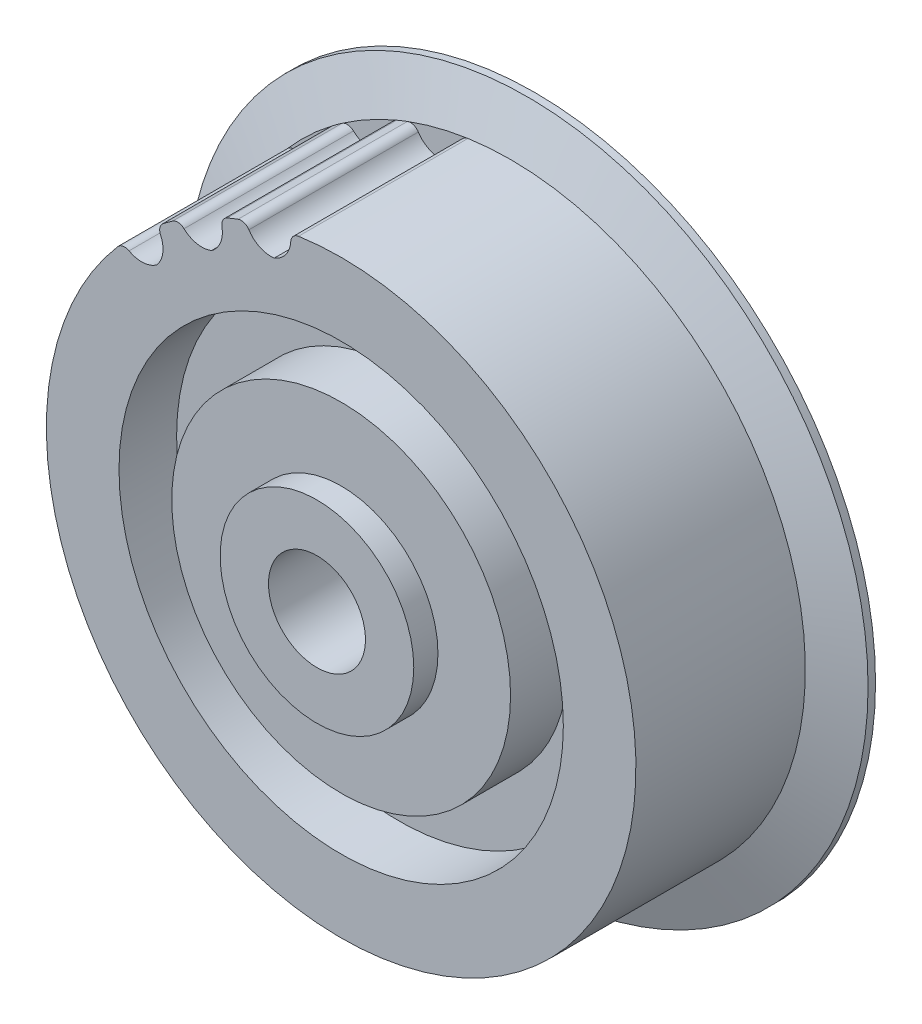
ISO-10303-21;
HEADER;
FILE_DESCRIPTION(('STEP AP214'),'2;1');
FILE_NAME('part.step','',(''),(''),'','','');
FILE_SCHEMA(('AUTOMOTIVE_DESIGN { 1 0 10303 214 1 1 1 1 }'));
ENDSEC;
DATA;
#1=APPLICATION_CONTEXT('core data for automotive mechanical design processes');
#2=APPLICATION_PROTOCOL_DEFINITION('international standard','automotive_design',2000,#1);
#3=PRODUCT_CONTEXT('',#1,'mechanical');
#4=PRODUCT('Part','Part','',(#3));
#5=PRODUCT_RELATED_PRODUCT_CATEGORY('part','',(#4));
#6=PRODUCT_DEFINITION_FORMATION('','',#4);
#7=PRODUCT_DEFINITION_CONTEXT('part definition',#1,'design');
#8=PRODUCT_DEFINITION('design','',#6,#7);
#9=PRODUCT_DEFINITION_SHAPE('','',#8);
#10=(LENGTH_UNIT() NAMED_UNIT(*) SI_UNIT(.MILLI.,.METRE.));
#11=(NAMED_UNIT(*) PLANE_ANGLE_UNIT() SI_UNIT($,.RADIAN.));
#12=(NAMED_UNIT(*) SI_UNIT($,.STERADIAN.) SOLID_ANGLE_UNIT());
#13=UNCERTAINTY_MEASURE_WITH_UNIT(LENGTH_MEASURE(1.E-05),#10,'distance_accuracy_value','');
#14=(GEOMETRIC_REPRESENTATION_CONTEXT(3) GLOBAL_UNCERTAINTY_ASSIGNED_CONTEXT((#13)) GLOBAL_UNIT_ASSIGNED_CONTEXT((#10,
#11,#12)) REPRESENTATION_CONTEXT('',''));
#15=CARTESIAN_POINT('',(0.,0.,0.));
#16=DIRECTION('',(0.,0.,1.));
#17=DIRECTION('',(1.,0.,0.));
#18=AXIS2_PLACEMENT_3D('',#15,#16,#17);
#19=CARTESIAN_POINT('',(0.,0.,7.14375));
#20=DIRECTION('',(0.,0.,-1.));
#21=DIRECTION('',(-1.,0.,0.));
#22=AXIS2_PLACEMENT_3D('',#19,#20,#21);
#23=CYLINDRICAL_SURFACE('',#22,3.18135);
#24=CARTESIAN_POINT('',(0.,0.,-13.49375));
#25=DIRECTION('',(0.,0.,-1.));
#26=DIRECTION('',(-1.,0.,0.));
#27=AXIS2_PLACEMENT_3D('',#24,#25,#26);
#28=CIRCLE('',#27,3.18135);
#29=CARTESIAN_POINT('',(-3.18135,0.,-13.49375));
#30=VERTEX_POINT('',#29);
#31=EDGE_CURVE('E19',#30,#30,#28,.F.);
#32=ORIENTED_EDGE('',*,*,#31,.F.);
#33=EDGE_LOOP('',(#32));
#34=FACE_BOUND('',#33,.T.);
#35=CARTESIAN_POINT('',(0.,0.,7.14375));
#36=DIRECTION('',(0.,0.,-1.));
#37=DIRECTION('',(-1.,0.,0.));
#38=AXIS2_PLACEMENT_3D('',#35,#36,#37);
#39=CIRCLE('',#38,3.18135);
#40=CARTESIAN_POINT('',(-3.18135,0.,7.14375));
#41=VERTEX_POINT('',#40);
#42=EDGE_CURVE('E270',#41,#41,#39,.T.);
#43=ORIENTED_EDGE('',*,*,#42,.F.);
#44=EDGE_LOOP('',(#43));
#45=FACE_BOUND('',#44,.T.);
#46=ADVANCED_FACE('F16',(#34,#45),#23,.F.);
#47=CARTESIAN_POINT('',(0.,0.,-13.49375));
#48=DIRECTION('',(0.,0.,-1.));
#49=DIRECTION('',(-1.,0.,0.));
#50=AXIS2_PLACEMENT_3D('',#47,#48,#49);
#51=PLANE('',#50);
#52=ORIENTED_EDGE('',*,*,#31,.T.);
#53=EDGE_LOOP('',(#52));
#54=FACE_BOUND('',#53,.T.);
#55=CARTESIAN_POINT('',(0.,0.,-13.49375));
#56=DIRECTION('',(0.,0.,-1.));
#57=DIRECTION('',(-1.,0.,0.));
#58=AXIS2_PLACEMENT_3D('',#55,#56,#57);
#59=CIRCLE('',#58,11.1125);
#60=CARTESIAN_POINT('',(-11.1125,0.,-13.49375));
#61=VERTEX_POINT('',#60);
#62=EDGE_CURVE('E268',#61,#61,#59,.F.);
#63=ORIENTED_EDGE('',*,*,#62,.F.);
#64=EDGE_LOOP('',(#63));
#65=FACE_BOUND('',#64,.T.);
#66=ADVANCED_FACE('F277',(#54,#65),#51,.T.);
#67=CARTESIAN_POINT('',(0.,0.,7.14375));
#68=DIRECTION('',(0.,0.,1.));
#69=DIRECTION('',(1.,0.,0.));
#70=AXIS2_PLACEMENT_3D('',#67,#68,#69);
#71=PLANE('',#70);
#72=ORIENTED_EDGE('',*,*,#42,.T.);
#73=EDGE_LOOP('',(#72));
#74=FACE_BOUND('',#73,.T.);
#75=CARTESIAN_POINT('',(0.,0.,7.14375));
#76=DIRECTION('',(0.,0.,1.));
#77=DIRECTION('',(1.,0.,0.));
#78=AXIS2_PLACEMENT_3D('',#75,#76,#77);
#79=CIRCLE('',#78,6.35);
#80=CARTESIAN_POINT('',(6.35,0.,7.14375));
#81=VERTEX_POINT('',#80);
#82=EDGE_CURVE('E265',#81,#81,#79,.F.);
#83=ORIENTED_EDGE('',*,*,#82,.F.);
#84=EDGE_LOOP('',(#83));
#85=FACE_BOUND('',#84,.T.);
#86=ADVANCED_FACE('F286',(#74,#85),#71,.T.);
#87=CARTESIAN_POINT('',(0.,0.,-7.14375));
#88=DIRECTION('',(0.,0.,-1.));
#89=DIRECTION('',(-1.,0.,0.));
#90=AXIS2_PLACEMENT_3D('',#87,#88,#89);
#91=CYLINDRICAL_SURFACE('',#90,11.1125);
#92=CARTESIAN_POINT('',(0.,0.,-1.778));
#93=DIRECTION('',(0.,0.,-1.));
#94=DIRECTION('',(-1.,0.,0.));
#95=AXIS2_PLACEMENT_3D('',#92,#93,#94);
#96=CIRCLE('',#95,11.1125);
#97=CARTESIAN_POINT('',(-11.1125,0.,-1.778));
#98=VERTEX_POINT('',#97);
#99=EDGE_CURVE('E262',#98,#98,#96,.T.);
#100=ORIENTED_EDGE('',*,*,#99,.T.);
#101=EDGE_LOOP('',(#100));
#102=FACE_BOUND('',#101,.T.);
#103=ORIENTED_EDGE('',*,*,#62,.T.);
#104=EDGE_LOOP('',(#103));
#105=FACE_BOUND('',#104,.T.);
#106=ADVANCED_FACE('F400',(#102,#105),#91,.T.);
#107=CARTESIAN_POINT('',(0.,0.,5.55625));
#108=DIRECTION('',(0.,0.,1.));
#109=DIRECTION('',(1.,0.,0.));
#110=AXIS2_PLACEMENT_3D('',#107,#108,#109);
#111=CYLINDRICAL_SURFACE('',#110,6.35);
#112=ORIENTED_EDGE('',*,*,#82,.T.);
#113=EDGE_LOOP('',(#112));
#114=FACE_BOUND('',#113,.T.);
#115=CARTESIAN_POINT('',(0.,0.,5.55625));
#116=DIRECTION('',(0.,0.,1.));
#117=DIRECTION('',(1.,0.,0.));
#118=AXIS2_PLACEMENT_3D('',#115,#116,#117);
#119=CIRCLE('',#118,6.35);
#120=CARTESIAN_POINT('',(6.35,0.,5.55625));
#121=VERTEX_POINT('',#120);
#122=EDGE_CURVE('E259',#121,#121,#119,.F.);
#123=ORIENTED_EDGE('',*,*,#122,.F.);
#124=EDGE_LOOP('',(#123));
#125=FACE_BOUND('',#124,.T.);
#126=ADVANCED_FACE('F396',(#114,#125),#111,.T.);
#127=CARTESIAN_POINT('',(0.,0.,-1.778));
#128=DIRECTION('',(0.,0.,1.));
#129=DIRECTION('',(1.,0.,0.));
#130=AXIS2_PLACEMENT_3D('',#127,#128,#129);
#131=PLANE('',#130);
#132=ORIENTED_EDGE('',*,*,#99,.F.);
#133=EDGE_LOOP('',(#132));
#134=FACE_BOUND('',#133,.T.);
#135=CARTESIAN_POINT('',(0.,0.,-1.778));
#136=DIRECTION('',(0.,0.,1.));
#137=DIRECTION('',(1.,0.,0.));
#138=AXIS2_PLACEMENT_3D('',#135,#136,#137);
#139=CIRCLE('',#138,14.57325);
#140=CARTESIAN_POINT('',(14.57325,0.,-1.778));
#141=VERTEX_POINT('',#140);
#142=EDGE_CURVE('E132',#141,#141,#139,.F.);
#143=ORIENTED_EDGE('',*,*,#142,.T.);
#144=EDGE_LOOP('',(#143));
#145=FACE_BOUND('',#144,.T.);
#146=ADVANCED_FACE('F392',(#134,#145),#131,.F.);
#147=CARTESIAN_POINT('',(0.,0.,5.55625));
#148=DIRECTION('',(0.,0.,1.));
#149=DIRECTION('',(1.,0.,0.));
#150=AXIS2_PLACEMENT_3D('',#147,#148,#149);
#151=PLANE('',#150);
#152=ORIENTED_EDGE('',*,*,#122,.T.);
#153=EDGE_LOOP('',(#152));
#154=FACE_BOUND('',#153,.T.);
#155=CARTESIAN_POINT('',(0.,0.,5.55625));
#156=DIRECTION('',(0.,0.,1.));
#157=DIRECTION('',(1.,0.,0.));
#158=AXIS2_PLACEMENT_3D('',#155,#156,#157);
#159=CIRCLE('',#158,11.1125);
#160=CARTESIAN_POINT('',(11.1125,0.,5.55625));
#161=VERTEX_POINT('',#160);
#162=EDGE_CURVE('E150',#161,#161,#159,.F.);
#163=ORIENTED_EDGE('',*,*,#162,.F.);
#164=EDGE_LOOP('',(#163));
#165=FACE_BOUND('',#164,.T.);
#166=ADVANCED_FACE('F388',(#154,#165),#151,.T.);
#167=CARTESIAN_POINT('',(0.,0.,-7.77875));
#168=DIRECTION('',(0.,0.,1.));
#169=DIRECTION('',(1.,0.,0.));
#170=AXIS2_PLACEMENT_3D('',#167,#168,#169);
#171=CYLINDRICAL_SURFACE('',#170,14.57325);
#172=ORIENTED_EDGE('',*,*,#142,.F.);
#173=EDGE_LOOP('',(#172));
#174=FACE_BOUND('',#173,.T.);
#175=CARTESIAN_POINT('',(0.,0.,-7.14375));
#176=DIRECTION('',(0.,0.,1.));
#177=DIRECTION('',(1.,0.,0.));
#178=AXIS2_PLACEMENT_3D('',#175,#176,#177);
#179=CIRCLE('',#178,14.57325);
#180=CARTESIAN_POINT('',(14.57325,0.,-7.14375));
#181=VERTEX_POINT('',#180);
#182=EDGE_CURVE('E147',#181,#181,#179,.F.);
#183=ORIENTED_EDGE('',*,*,#182,.T.);
#184=EDGE_LOOP('',(#183));
#185=FACE_BOUND('',#184,.T.);
#186=ADVANCED_FACE('F385',(#174,#185),#171,.F.);
#187=CARTESIAN_POINT('',(0.,0.,-5.55625));
#188=DIRECTION('',(0.,0.,1.));
#189=DIRECTION('',(1.,0.,0.));
#190=AXIS2_PLACEMENT_3D('',#187,#188,#189);
#191=CYLINDRICAL_SURFACE('',#190,19.33575);
#192=CARTESIAN_POINT('',(0.,0.,-5.55625));
#193=DIRECTION('',(0.,0.,1.));
#194=DIRECTION('',(1.,0.,0.));
#195=AXIS2_PLACEMENT_3D('',#192,#193,#194);
#196=CIRCLE('',#195,19.33575);
#197=CARTESIAN_POINT('',(-6.76746682181264,18.1127750739119,-5.55625000000021));
#198=VERTEX_POINT('',#197);
#199=CARTESIAN_POINT('',(-7.46577675699837,17.8362946117506,-5.55625));
#200=VERTEX_POINT('',#199);
#201=EDGE_CURVE('E131',#198,#200,#196,.T.);
#202=ORIENTED_EDGE('',*,*,#201,.T.);
#203=DIRECTION('',(0.,0.,1.));
#204=VECTOR('',#203,1.);
#205=CARTESIAN_POINT('',(-7.4657767571594,17.836294611683,5.55625));
#206=LINE('',#205,#204);
#207=CARTESIAN_POINT('',(-7.46577675715956,17.836294611683,5.55625));
#208=VERTEX_POINT('',#207);
#209=EDGE_CURVE('E129',#208,#200,#206,.F.);
#210=ORIENTED_EDGE('',*,*,#209,.F.);
#211=CARTESIAN_POINT('',(0.,0.,5.55625));
#212=DIRECTION('',(0.,0.,1.));
#213=DIRECTION('',(1.,0.,0.));
#214=AXIS2_PLACEMENT_3D('',#211,#212,#213);
#215=CIRCLE('',#214,19.33575);
#216=CARTESIAN_POINT('',(-6.76746682181282,18.1127750739124,5.55625));
#217=VERTEX_POINT('',#216);
#218=EDGE_CURVE('E120',#208,#217,#215,.F.);
#219=ORIENTED_EDGE('',*,*,#218,.T.);
#220=DIRECTION('',(0.,0.,1.));
#221=VECTOR('',#220,1.);
#222=CARTESIAN_POINT('',(-6.76746682200894,18.1127750738386,5.55625));
#223=LINE('',#222,#221);
#224=EDGE_CURVE('E126',#198,#217,#223,.T.);
#225=ORIENTED_EDGE('',*,*,#224,.F.);
#226=EDGE_LOOP('',(#202,#210,#219,#225));
#227=FACE_BOUND('',#226,.T.);
#228=ADVANCED_FACE('F124',(#227),#191,.T.);
#229=CARTESIAN_POINT('',(0.,0.,-5.55625));
#230=DIRECTION('',(0.,0.,1.));
#231=DIRECTION('',(1.,0.,0.));
#232=AXIS2_PLACEMENT_3D('',#229,#230,#231);
#233=CYLINDRICAL_SURFACE('',#232,19.33575);
#234=CARTESIAN_POINT('',(0.,0.,-5.55625));
#235=DIRECTION('',(0.,0.,1.));
#236=DIRECTION('',(1.,0.,0.));
#237=AXIS2_PLACEMENT_3D('',#234,#235,#236);
#238=CIRCLE('',#237,19.33575);
#239=CARTESIAN_POINT('',(-11.05931839647,15.8607283776005,-5.55625000000036));
#240=VERTEX_POINT('',#239);
#241=CARTESIAN_POINT('',(-11.6669317459823,15.4192714385952,-5.55624999999999));
#242=VERTEX_POINT('',#241);
#243=EDGE_CURVE('E162',#240,#242,#238,.T.);
#244=ORIENTED_EDGE('',*,*,#243,.T.);
#245=DIRECTION('',(0.,0.,1.));
#246=VECTOR('',#245,1.);
#247=CARTESIAN_POINT('',(-11.6669317461483,15.4192714384694,5.55625));
#248=LINE('',#247,#246);
#249=CARTESIAN_POINT('',(-11.6669317461493,15.419271438469,5.55625));
#250=VERTEX_POINT('',#249);
#251=EDGE_CURVE('E154',#250,#242,#248,.F.);
#252=ORIENTED_EDGE('',*,*,#251,.F.);
#253=CARTESIAN_POINT('',(0.,0.,5.55625));
#254=DIRECTION('',(0.,0.,1.));
#255=DIRECTION('',(1.,0.,0.));
#256=AXIS2_PLACEMENT_3D('',#253,#254,#255);
#257=CIRCLE('',#256,19.33575);
#258=CARTESIAN_POINT('',(-11.05931839647,15.8607283776005,5.55625));
#259=VERTEX_POINT('',#258);
#260=EDGE_CURVE('E164',#250,#259,#257,.F.);
#261=ORIENTED_EDGE('',*,*,#260,.T.);
#262=DIRECTION('',(0.,0.,1.));
#263=VECTOR('',#262,1.);
#264=CARTESIAN_POINT('',(-11.0593183966332,15.8607283774874,5.55625));
#265=LINE('',#264,#263);
#266=EDGE_CURVE('E158',#240,#259,#265,.T.);
#267=ORIENTED_EDGE('',*,*,#266,.F.);
#268=EDGE_LOOP('',(#244,#252,#261,#267));
#269=FACE_BOUND('',#268,.T.);
#270=ADVANCED_FACE('F378',(#269),#233,.T.);
#271=CARTESIAN_POINT('',(0.,0.,-7.77875));
#272=DIRECTION('',(0.,0.,1.));
#273=DIRECTION('',(1.,0.,0.));
#274=AXIS2_PLACEMENT_3D('',#271,#272,#273);
#275=CYLINDRICAL_SURFACE('',#274,11.1125);
#276=CARTESIAN_POINT('',(0.,0.,1.778));
#277=DIRECTION('',(0.,0.,1.));
#278=DIRECTION('',(1.,0.,0.));
#279=AXIS2_PLACEMENT_3D('',#276,#277,#278);
#280=CIRCLE('',#279,11.1125);
#281=CARTESIAN_POINT('',(11.1125,0.,1.778));
#282=VERTEX_POINT('',#281);
#283=EDGE_CURVE('E246',#282,#282,#280,.F.);
#284=ORIENTED_EDGE('',*,*,#283,.F.);
#285=EDGE_LOOP('',(#284));
#286=FACE_BOUND('',#285,.T.);
#287=ORIENTED_EDGE('',*,*,#162,.T.);
#288=EDGE_LOOP('',(#287));
#289=FACE_BOUND('',#288,.T.);
#290=ADVANCED_FACE('F374',(#286,#289),#275,.T.);
#291=CARTESIAN_POINT('',(0.,0.,-7.14375));
#292=DIRECTION('',(0.,0.,1.));
#293=DIRECTION('',(1.,0.,0.));
#294=AXIS2_PLACEMENT_3D('',#291,#292,#293);
#295=PLANE('',#294);
#296=ORIENTED_EDGE('',*,*,#182,.F.);
#297=EDGE_LOOP('',(#296));
#298=FACE_BOUND('',#297,.T.);
#299=CARTESIAN_POINT('',(0.,0.,-7.14375));
#300=DIRECTION('',(0.,0.,1.));
#301=DIRECTION('',(1.,0.,0.));
#302=AXIS2_PLACEMENT_3D('',#299,#300,#301);
#303=CIRCLE('',#302,22.352);
#304=CARTESIAN_POINT('',(22.352,0.,-7.14375));
#305=VERTEX_POINT('',#304);
#306=EDGE_CURVE('E233',#305,#305,#303,.T.);
#307=ORIENTED_EDGE('',*,*,#306,.F.);
#308=EDGE_LOOP('',(#307));
#309=FACE_BOUND('',#308,.T.);
#310=ADVANCED_FACE('F371',(#298,#309),#295,.F.);
#311=CARTESIAN_POINT('',(-6.55766423772124,17.5512493048607,5.55625));
#312=DIRECTION('',(0.,0.,1.));
#313=DIRECTION('',(1.,0.,0.));
#314=AXIS2_PLACEMENT_3D('',#311,#312,#313);
#315=CYLINDRICAL_SURFACE('',#314,0.59944);
#316=ORIENTED_EDGE('',*,*,#224,.T.);
#317=CARTESIAN_POINT('',(-6.55766423772124,17.5512493048607,5.55625));
#318=DIRECTION('',(0.,0.,1.));
#319=DIRECTION('',(1.,0.,0.));
#320=AXIS2_PLACEMENT_3D('',#317,#318,#319);
#321=CIRCLE('',#320,0.59944);
#322=CARTESIAN_POINT('',(-6.0509555970019,17.8715221057977,5.55625));
#323=VERTEX_POINT('',#322);
#324=EDGE_CURVE('E135',#217,#323,#321,.F.);
#325=ORIENTED_EDGE('',*,*,#324,.T.);
#326=DIRECTION('',(0.,0.,1.));
#327=VECTOR('',#326,1.);
#328=CARTESIAN_POINT('',(-6.05095559700222,17.8715221057976,5.55625));
#329=LINE('',#328,#327);
#330=CARTESIAN_POINT('',(-6.0509555970019,17.8715221057977,-5.55625));
#331=VERTEX_POINT('',#330);
#332=EDGE_CURVE('E224',#323,#331,#329,.F.);
#333=ORIENTED_EDGE('',*,*,#332,.T.);
#334=CARTESIAN_POINT('',(-6.55766423772124,17.5512493048607,-5.55625));
#335=DIRECTION('',(0.,0.,1.));
#336=DIRECTION('',(1.,0.,0.));
#337=AXIS2_PLACEMENT_3D('',#334,#335,#336);
#338=CIRCLE('',#337,0.59944);
#339=EDGE_CURVE('E145',#198,#331,#338,.F.);
#340=ORIENTED_EDGE('',*,*,#339,.F.);
#341=EDGE_LOOP('',(#316,#325,#333,#340));
#342=FACE_BOUND('',#341,.T.);
#343=ADVANCED_FACE('F143',(#342),#315,.T.);
#344=CARTESIAN_POINT('',(-7.23432541861258,17.2833401908807,5.55625));
#345=DIRECTION('',(0.,0.,1.));
#346=DIRECTION('',(1.,0.,0.));
#347=AXIS2_PLACEMENT_3D('',#344,#345,#346);
#348=CYLINDRICAL_SURFACE('',#347,0.59944);
#349=DIRECTION('',(0.,0.,1.));
#350=VECTOR('',#349,1.);
#351=CARTESIAN_POINT('',(-7.82294193993073,17.1699430814267,5.55625));
#352=LINE('',#351,#350);
#353=CARTESIAN_POINT('',(-7.82294193993019,17.1699430814265,-5.55625));
#354=VERTEX_POINT('',#353);
#355=CARTESIAN_POINT('',(-7.82294193993019,17.1699430814265,5.55625));
#356=VERTEX_POINT('',#355);
#357=EDGE_CURVE('E220',#354,#356,#352,.T.);
#358=ORIENTED_EDGE('',*,*,#357,.T.);
#359=CARTESIAN_POINT('',(-7.23432541861258,17.2833401908807,5.55625));
#360=DIRECTION('',(0.,0.,1.));
#361=DIRECTION('',(1.,0.,0.));
#362=AXIS2_PLACEMENT_3D('',#359,#360,#361);
#363=CIRCLE('',#362,0.59944);
#364=EDGE_CURVE('E157',#356,#208,#363,.F.);
#365=ORIENTED_EDGE('',*,*,#364,.T.);
#366=ORIENTED_EDGE('',*,*,#209,.T.);
#367=CARTESIAN_POINT('',(-7.23432541861258,17.2833401908807,-5.55625));
#368=DIRECTION('',(0.,0.,1.));
#369=DIRECTION('',(1.,0.,0.));
#370=AXIS2_PLACEMENT_3D('',#367,#368,#369);
#371=CIRCLE('',#370,0.59944);
#372=EDGE_CURVE('E240',#354,#200,#371,.F.);
#373=ORIENTED_EDGE('',*,*,#372,.F.);
#374=EDGE_LOOP('',(#358,#365,#366,#373));
#375=FACE_BOUND('',#374,.T.);
#376=ADVANCED_FACE('F364',(#375),#348,.T.);
#377=CARTESIAN_POINT('',(-10.7164613662216,15.3690197541164,5.55625));
#378=DIRECTION('',(0.,0.,1.));
#379=DIRECTION('',(1.,0.,0.));
#380=AXIS2_PLACEMENT_3D('',#377,#378,#379);
#381=CYLINDRICAL_SURFACE('',#380,0.59944);
#382=ORIENTED_EDGE('',*,*,#266,.T.);
#383=CARTESIAN_POINT('',(-10.7164613662216,15.3690197541164,5.55625));
#384=DIRECTION('',(0.,0.,1.));
#385=DIRECTION('',(1.,0.,0.));
#386=AXIS2_PLACEMENT_3D('',#383,#384,#385);
#387=CIRCLE('',#386,0.59944);
#388=CARTESIAN_POINT('',(-10.3053205159492,15.8052439107573,5.55625));
#389=VERTEX_POINT('',#388);
#390=EDGE_CURVE('E161',#259,#389,#387,.F.);
#391=ORIENTED_EDGE('',*,*,#390,.T.);
#392=DIRECTION('',(0.,0.,1.));
#393=VECTOR('',#392,1.);
#394=CARTESIAN_POINT('',(-10.3053205159495,15.8052439107573,5.55625));
#395=LINE('',#394,#393);
#396=CARTESIAN_POINT('',(-10.3053205159492,15.8052439107573,-5.55625));
#397=VERTEX_POINT('',#396);
#398=EDGE_CURVE('E216',#389,#397,#395,.F.);
#399=ORIENTED_EDGE('',*,*,#398,.T.);
#400=CARTESIAN_POINT('',(-10.7164613662216,15.3690197541164,-5.55625));
#401=DIRECTION('',(0.,0.,1.));
#402=DIRECTION('',(1.,0.,0.));
#403=AXIS2_PLACEMENT_3D('',#400,#401,#402);
#404=CIRCLE('',#403,0.59944);
#405=EDGE_CURVE('E243',#240,#397,#404,.F.);
#406=ORIENTED_EDGE('',*,*,#405,.F.);
#407=EDGE_LOOP('',(#382,#391,#399,#406));
#408=FACE_BOUND('',#407,.T.);
#409=ADVANCED_FACE('F360',(#408),#381,.T.);
#410=CARTESIAN_POINT('',(-11.3052377044959,14.9412487048749,5.55625));
#411=DIRECTION('',(0.,0.,1.));
#412=DIRECTION('',(1.,0.,0.));
#413=AXIS2_PLACEMENT_3D('',#410,#411,#412);
#414=CYLINDRICAL_SURFACE('',#413,0.59944);
#415=DIRECTION('',(0.,0.,1.));
#416=VECTOR('',#415,1.);
#417=CARTESIAN_POINT('',(-11.8471610410491,14.685031197868,5.55625));
#418=LINE('',#417,#416);
#419=CARTESIAN_POINT('',(-11.8471610410499,14.6850311978676,-5.55625));
#420=VERTEX_POINT('',#419);
#421=CARTESIAN_POINT('',(-11.8471610410499,14.6850311978676,5.55625));
#422=VERTEX_POINT('',#421);
#423=EDGE_CURVE('E209',#420,#422,#418,.T.);
#424=ORIENTED_EDGE('',*,*,#423,.T.);
#425=CARTESIAN_POINT('',(-11.3052377044959,14.9412487048749,5.55625));
#426=DIRECTION('',(0.,0.,1.));
#427=DIRECTION('',(1.,0.,0.));
#428=AXIS2_PLACEMENT_3D('',#425,#426,#427);
#429=CIRCLE('',#428,0.59944);
#430=EDGE_CURVE('E249',#422,#250,#429,.F.);
#431=ORIENTED_EDGE('',*,*,#430,.T.);
#432=ORIENTED_EDGE('',*,*,#251,.T.);
#433=CARTESIAN_POINT('',(-11.3052377044959,14.9412487048749,-5.55625));
#434=DIRECTION('',(0.,0.,1.));
#435=DIRECTION('',(1.,0.,0.));
#436=AXIS2_PLACEMENT_3D('',#433,#434,#435);
#437=CIRCLE('',#436,0.59944);
#438=EDGE_CURVE('E228',#420,#242,#437,.F.);
#439=ORIENTED_EDGE('',*,*,#438,.F.);
#440=EDGE_LOOP('',(#424,#431,#432,#439));
#441=FACE_BOUND('',#440,.T.);
#442=ADVANCED_FACE('F356',(#441),#414,.T.);
#443=CARTESIAN_POINT('',(0.,0.,1.778));
#444=DIRECTION('',(0.,0.,1.));
#445=DIRECTION('',(1.,0.,0.));
#446=AXIS2_PLACEMENT_3D('',#443,#444,#445);
#447=PLANE('',#446);
#448=ORIENTED_EDGE('',*,*,#283,.T.);
#449=EDGE_LOOP('',(#448));
#450=FACE_BOUND('',#449,.T.);
#451=CARTESIAN_POINT('',(0.,0.,1.778));
#452=DIRECTION('',(0.,0.,1.));
#453=DIRECTION('',(1.,0.,0.));
#454=AXIS2_PLACEMENT_3D('',#451,#452,#453);
#455=CIRCLE('',#454,14.57325);
#456=CARTESIAN_POINT('',(14.57325,0.,1.778));
#457=VERTEX_POINT('',#456);
#458=EDGE_CURVE('E206',#457,#457,#455,.T.);
#459=ORIENTED_EDGE('',*,*,#458,.T.);
#460=EDGE_LOOP('',(#459));
#461=FACE_BOUND('',#460,.T.);
#462=ADVANCED_FACE('F352',(#450,#461),#447,.T.);
#463=CARTESIAN_POINT('',(0.,0.,-5.55625));
#464=DIRECTION('',(0.,0.,1.));
#465=DIRECTION('',(1.,0.,0.));
#466=AXIS2_PLACEMENT_3D('',#463,#464,#465);
#467=PLANE('',#466);
#468=ORIENTED_EDGE('',*,*,#372,.T.);
#469=CARTESIAN_POINT('',(0.,0.,-5.55625000000071));
#470=DIRECTION('',(0.,0.,-1.));
#471=DIRECTION('',(-1.,0.,0.));
#472=AXIS2_PLACEMENT_3D('',#469,#470,#471);
#473=CIRCLE('',#472,19.33575);
#474=EDGE_CURVE('E200',#240,#200,#473,.T.);
#475=ORIENTED_EDGE('',*,*,#474,.F.);
#476=ORIENTED_EDGE('',*,*,#405,.T.);
#477=CARTESIAN_POINT('',(-9.13984073276102,17.0418284903871,-5.55625));
#478=DIRECTION('',(0.,0.,1.));
#479=DIRECTION('',(1.,0.,0.));
#480=AXIS2_PLACEMENT_3D('',#477,#478,#479);
#481=CIRCLE('',#480,1.69925999999975);
#482=CARTESIAN_POINT('',(-8.50278336365236,15.4665055215761,-5.55625));
#483=VERTEX_POINT('',#482);
#484=EDGE_CURVE('E214',#397,#483,#481,.T.);
#485=ORIENTED_EDGE('',*,*,#484,.T.);
#486=CARTESIAN_POINT('',(-9.4915201295964,16.8484911058968,-5.55625));
#487=DIRECTION('',(0.,0.,1.));
#488=DIRECTION('',(1.,0.,0.));
#489=AXIS2_PLACEMENT_3D('',#486,#487,#488);
#490=CIRCLE('',#489,1.69926);
#491=EDGE_CURVE('E217',#483,#354,#490,.T.);
#492=ORIENTED_EDGE('',*,*,#491,.T.);
#493=EDGE_LOOP('',(#468,#475,#476,#485,#492));
#494=FACE_BOUND('',#493,.T.);
#495=ADVANCED_FACE('F348',(#494),#467,.T.);
#496=CARTESIAN_POINT('',(0.,0.,-5.55625));
#497=DIRECTION('',(0.,0.,1.));
#498=DIRECTION('',(1.,0.,0.));
#499=AXIS2_PLACEMENT_3D('',#496,#497,#498);
#500=PLANE('',#499);
#501=CARTESIAN_POINT('',(-2.7088538606914,18.5394558490126,-5.55625));
#502=DIRECTION('',(0.,0.,1.));
#503=DIRECTION('',(1.,0.,0.));
#504=AXIS2_PLACEMENT_3D('',#501,#502,#503);
#505=CIRCLE('',#504,0.59944);
#506=CARTESIAN_POINT('',(-3.30717862595625,18.576004294544,-5.55625));
#507=VERTEX_POINT('',#506);
#508=CARTESIAN_POINT('',(-2.79551955710474,19.132597797171,-5.55625000000021));
#509=VERTEX_POINT('',#508);
#510=EDGE_CURVE('E236',#507,#509,#505,.F.);
#511=ORIENTED_EDGE('',*,*,#510,.T.);
#512=CARTESIAN_POINT('',(0.,0.,-5.55625000000043));
#513=DIRECTION('',(0.,0.,-1.));
#514=DIRECTION('',(-1.,0.,0.));
#515=AXIS2_PLACEMENT_3D('',#512,#513,#514);
#516=CIRCLE('',#515,19.3357499999992);
#517=EDGE_CURVE('E197',#198,#509,#516,.T.);
#518=ORIENTED_EDGE('',*,*,#517,.F.);
#519=ORIENTED_EDGE('',*,*,#339,.T.);
#520=CARTESIAN_POINT('',(-4.61456542479278,18.7794140711653,-5.55625));
#521=DIRECTION('',(0.,0.,1.));
#522=DIRECTION('',(1.,0.,0.));
#523=AXIS2_PLACEMENT_3D('',#520,#521,#522);
#524=CIRCLE('',#523,1.69925999999975);
#525=CARTESIAN_POINT('',(-4.38928927576162,17.0951530449948,-5.55625));
#526=VERTEX_POINT('',#525);
#527=EDGE_CURVE('E222',#331,#526,#524,.T.);
#528=ORIENTED_EDGE('',*,*,#527,.T.);
#529=CARTESIAN_POINT('',(-5.0032772190161,18.6796098456484,-5.55625));
#530=DIRECTION('',(0.,0.,1.));
#531=DIRECTION('',(1.,0.,0.));
#532=AXIS2_PLACEMENT_3D('',#529,#530,#531);
#533=CIRCLE('',#532,1.69926);
#534=EDGE_CURVE('E225',#526,#507,#533,.T.);
#535=ORIENTED_EDGE('',*,*,#534,.T.);
#536=EDGE_LOOP('',(#511,#518,#519,#528,#535));
#537=FACE_BOUND('',#536,.T.);
#538=ADVANCED_FACE('F344',(#537),#500,.T.);
#539=CARTESIAN_POINT('',(0.,0.,-7.223125));
#540=DIRECTION('',(0.,0.,1.));
#541=DIRECTION('',(1.,0.,0.));
#542=AXIS2_PLACEMENT_3D('',#539,#540,#541);
#543=CYLINDRICAL_SURFACE('',#542,22.352);
#544=ORIENTED_EDGE('',*,*,#306,.T.);
#545=EDGE_LOOP('',(#544));
#546=FACE_BOUND('',#545,.T.);
#547=CARTESIAN_POINT('',(0.,0.,-6.65407521910674));
#548=DIRECTION('',(0.,0.,-1.));
#549=DIRECTION('',(0.,-1.,0.));
#550=AXIS2_PLACEMENT_3D('',#547,#548,#549);
#551=CIRCLE('',#550,22.3519999999994);
#552=CARTESIAN_POINT('',(0.,-22.3519999999994,-6.65407521910674));
#553=VERTEX_POINT('',#552);
#554=EDGE_CURVE('E196',#553,#553,#551,.F.);
#555=ORIENTED_EDGE('',*,*,#554,.F.);
#556=EDGE_LOOP('',(#555));
#557=FACE_BOUND('',#556,.T.);
#558=ADVANCED_FACE('F340',(#546,#557),#543,.T.);
#559=CARTESIAN_POINT('',(0.,0.,-5.55625));
#560=DIRECTION('',(0.,0.,1.));
#561=DIRECTION('',(1.,0.,0.));
#562=AXIS2_PLACEMENT_3D('',#559,#560,#561);
#563=PLANE('',#562);
#564=ORIENTED_EDGE('',*,*,#438,.T.);
#565=CARTESIAN_POINT('',(0.,0.,-5.55625000000036));
#566=DIRECTION('',(0.,0.,-1.));
#567=DIRECTION('',(-1.,0.,0.));
#568=AXIS2_PLACEMENT_3D('',#565,#566,#567);
#569=CIRCLE('',#568,19.335749999999);
#570=CARTESIAN_POINT('',(-14.6562723228631,12.6120937857506,-5.55625000000017));
#571=VERTEX_POINT('',#570);
#572=EDGE_CURVE('E193',#571,#242,#569,.T.);
#573=ORIENTED_EDGE('',*,*,#572,.F.);
#574=CARTESIAN_POINT('',(-14.2019038146928,12.2210981689181,-5.55625));
#575=DIRECTION('',(0.,0.,1.));
#576=DIRECTION('',(1.,0.,0.));
#577=AXIS2_PLACEMENT_3D('',#574,#575,#576);
#578=CIRCLE('',#577,0.59944);
#579=CARTESIAN_POINT('',(-13.9121642465605,12.7458641131813,-5.55625));
#580=VERTEX_POINT('',#579);
#581=EDGE_CURVE('E231',#571,#580,#578,.F.);
#582=ORIENTED_EDGE('',*,*,#581,.T.);
#583=CARTESIAN_POINT('',(-13.0908262335073,14.2334421500946,-5.55625));
#584=DIRECTION('',(0.,0.,1.));
#585=DIRECTION('',(1.,0.,0.));
#586=AXIS2_PLACEMENT_3D('',#583,#584,#585);
#587=CIRCLE('',#586,1.69925999999975);
#588=CARTESIAN_POINT('',(-12.0820163017529,12.866040574407,-5.55625));
#589=VERTEX_POINT('',#588);
#590=EDGE_CURVE('E204',#580,#589,#587,.T.);
#591=ORIENTED_EDGE('',*,*,#590,.T.);
#592=CARTESIAN_POINT('',(-13.3833759230625,13.9587197055451,-5.55625));
#593=DIRECTION('',(0.,0.,1.));
#594=DIRECTION('',(1.,0.,0.));
#595=AXIS2_PLACEMENT_3D('',#592,#593,#594);
#596=CIRCLE('',#595,1.69926);
#597=EDGE_CURVE('E210',#589,#420,#596,.T.);
#598=ORIENTED_EDGE('',*,*,#597,.T.);
#599=EDGE_LOOP('',(#564,#573,#582,#591,#598));
#600=FACE_BOUND('',#599,.T.);
#601=ADVANCED_FACE('F336',(#600),#563,.T.);
#602=CARTESIAN_POINT('',(-5.0032772190161,18.6796098456484,5.55625));
#603=DIRECTION('',(0.,0.,1.));
#604=DIRECTION('',(1.,0.,0.));
#605=AXIS2_PLACEMENT_3D('',#602,#603,#604);
#606=CYLINDRICAL_SURFACE('',#605,1.69926);
#607=ORIENTED_EDGE('',*,*,#534,.F.);
#608=DIRECTION('',(0.,0.,1.));
#609=VECTOR('',#608,1.);
#610=CARTESIAN_POINT('',(-4.38928927576249,17.0951530449947,5.55625));
#611=LINE('',#610,#609);
#612=CARTESIAN_POINT('',(-4.38928927576162,17.0951530449948,5.55625));
#613=VERTEX_POINT('',#612);
#614=EDGE_CURVE('E221',#526,#613,#611,.T.);
#615=ORIENTED_EDGE('',*,*,#614,.T.);
#616=CARTESIAN_POINT('',(-5.0032772190161,18.6796098456484,5.55625));
#617=DIRECTION('',(0.,0.,1.));
#618=DIRECTION('',(1.,0.,0.));
#619=AXIS2_PLACEMENT_3D('',#616,#617,#618);
#620=CIRCLE('',#619,1.69926);
#621=CARTESIAN_POINT('',(-3.30717862595614,18.576004294544,5.55625));
#622=VERTEX_POINT('',#621);
#623=EDGE_CURVE('E187',#622,#613,#620,.F.);
#624=ORIENTED_EDGE('',*,*,#623,.F.);
#625=DIRECTION('',(0.,0.,1.));
#626=VECTOR('',#625,1.);
#627=CARTESIAN_POINT('',(-3.30717862595626,18.5760042945439,5.55625));
#628=LINE('',#627,#626);
#629=EDGE_CURVE('E192',#507,#622,#628,.T.);
#630=ORIENTED_EDGE('',*,*,#629,.F.);
#631=EDGE_LOOP('',(#607,#615,#624,#630));
#632=FACE_BOUND('',#631,.T.);
#633=ADVANCED_FACE('F332',(#632),#606,.F.);
#634=CARTESIAN_POINT('',(-4.61456542479278,18.7794140711653,5.55625));
#635=DIRECTION('',(0.,0.,1.));
#636=DIRECTION('',(1.,0.,0.));
#637=AXIS2_PLACEMENT_3D('',#634,#635,#636);
#638=CYLINDRICAL_SURFACE('',#637,1.69925999999975);
#639=ORIENTED_EDGE('',*,*,#527,.F.);
#640=ORIENTED_EDGE('',*,*,#332,.F.);
#641=CARTESIAN_POINT('',(-4.61456542479278,18.7794140711653,5.55625));
#642=DIRECTION('',(0.,0.,1.));
#643=DIRECTION('',(1.,0.,0.));
#644=AXIS2_PLACEMENT_3D('',#641,#642,#643);
#645=CIRCLE('',#644,1.69925999999975);
#646=EDGE_CURVE('E139',#613,#323,#645,.F.);
#647=ORIENTED_EDGE('',*,*,#646,.F.);
#648=ORIENTED_EDGE('',*,*,#614,.F.);
#649=EDGE_LOOP('',(#639,#640,#647,#648));
#650=FACE_BOUND('',#649,.T.);
#651=ADVANCED_FACE('F328',(#650),#638,.F.);
#652=CARTESIAN_POINT('',(-9.4915201295964,16.8484911058968,5.55625));
#653=DIRECTION('',(0.,0.,1.));
#654=DIRECTION('',(1.,0.,0.));
#655=AXIS2_PLACEMENT_3D('',#652,#653,#654);
#656=CYLINDRICAL_SURFACE('',#655,1.69926);
#657=ORIENTED_EDGE('',*,*,#491,.F.);
#658=DIRECTION('',(0.,0.,1.));
#659=VECTOR('',#658,1.);
#660=CARTESIAN_POINT('',(-8.50278336365277,15.466505521576,5.55625));
#661=LINE('',#660,#659);
#662=CARTESIAN_POINT('',(-8.50278336365236,15.4665055215761,5.55625));
#663=VERTEX_POINT('',#662);
#664=EDGE_CURVE('E213',#483,#663,#661,.T.);
#665=ORIENTED_EDGE('',*,*,#664,.T.);
#666=CARTESIAN_POINT('',(-9.4915201295964,16.8484911058968,5.55625));
#667=DIRECTION('',(0.,0.,1.));
#668=DIRECTION('',(1.,0.,0.));
#669=AXIS2_PLACEMENT_3D('',#666,#667,#668);
#670=CIRCLE('',#669,1.69926);
#671=EDGE_CURVE('E183',#356,#663,#670,.F.);
#672=ORIENTED_EDGE('',*,*,#671,.F.);
#673=ORIENTED_EDGE('',*,*,#357,.F.);
#674=EDGE_LOOP('',(#657,#665,#672,#673));
#675=FACE_BOUND('',#674,.T.);
#676=ADVANCED_FACE('F324',(#675),#656,.F.);
#677=CARTESIAN_POINT('',(-9.13984073276102,17.0418284903871,5.55625));
#678=DIRECTION('',(0.,0.,1.));
#679=DIRECTION('',(1.,0.,0.));
#680=AXIS2_PLACEMENT_3D('',#677,#678,#679);
#681=CYLINDRICAL_SURFACE('',#680,1.69925999999975);
#682=ORIENTED_EDGE('',*,*,#484,.F.);
#683=ORIENTED_EDGE('',*,*,#398,.F.);
#684=CARTESIAN_POINT('',(-9.13984073276102,17.0418284903871,5.55625));
#685=DIRECTION('',(0.,0.,1.));
#686=DIRECTION('',(1.,0.,0.));
#687=AXIS2_PLACEMENT_3D('',#684,#685,#686);
#688=CIRCLE('',#687,1.69925999999975);
#689=EDGE_CURVE('E180',#663,#389,#688,.F.);
#690=ORIENTED_EDGE('',*,*,#689,.F.);
#691=ORIENTED_EDGE('',*,*,#664,.F.);
#692=EDGE_LOOP('',(#682,#683,#690,#691));
#693=FACE_BOUND('',#692,.T.);
#694=ADVANCED_FACE('F320',(#693),#681,.F.);
#695=CARTESIAN_POINT('',(-13.3833759230625,13.9587197055451,5.55625));
#696=DIRECTION('',(0.,0.,1.));
#697=DIRECTION('',(1.,0.,0.));
#698=AXIS2_PLACEMENT_3D('',#695,#696,#697);
#699=CYLINDRICAL_SURFACE('',#698,1.69926);
#700=ORIENTED_EDGE('',*,*,#597,.F.);
#701=DIRECTION('',(0.,0.,1.));
#702=VECTOR('',#701,1.);
#703=CARTESIAN_POINT('',(-12.0820163017528,12.866040574407,5.55625));
#704=LINE('',#703,#702);
#705=CARTESIAN_POINT('',(-12.0820163017529,12.866040574407,5.55625));
#706=VERTEX_POINT('',#705);
#707=EDGE_CURVE('E203',#589,#706,#704,.T.);
#708=ORIENTED_EDGE('',*,*,#707,.T.);
#709=CARTESIAN_POINT('',(-13.3833759230625,13.9587197055451,5.55625));
#710=DIRECTION('',(0.,0.,1.));
#711=DIRECTION('',(1.,0.,0.));
#712=AXIS2_PLACEMENT_3D('',#709,#710,#711);
#713=CIRCLE('',#712,1.69926);
#714=EDGE_CURVE('E177',#422,#706,#713,.F.);
#715=ORIENTED_EDGE('',*,*,#714,.F.);
#716=ORIENTED_EDGE('',*,*,#423,.F.);
#717=EDGE_LOOP('',(#700,#708,#715,#716));
#718=FACE_BOUND('',#717,.T.);
#719=ADVANCED_FACE('F316',(#718),#699,.F.);
#720=CARTESIAN_POINT('',(0.,0.,-7.77875));
#721=DIRECTION('',(0.,0.,1.));
#722=DIRECTION('',(1.,0.,0.));
#723=AXIS2_PLACEMENT_3D('',#720,#721,#722);
#724=CYLINDRICAL_SURFACE('',#723,14.57325);
#725=ORIENTED_EDGE('',*,*,#458,.F.);
#726=EDGE_LOOP('',(#725));
#727=FACE_BOUND('',#726,.T.);
#728=CARTESIAN_POINT('',(0.,0.,5.55625));
#729=DIRECTION('',(0.,0.,1.));
#730=DIRECTION('',(1.,0.,0.));
#731=AXIS2_PLACEMENT_3D('',#728,#729,#730);
#732=CIRCLE('',#731,14.57325);
#733=CARTESIAN_POINT('',(14.57325,0.,5.55625));
#734=VERTEX_POINT('',#733);
#735=EDGE_CURVE('E172',#734,#734,#732,.F.);
#736=ORIENTED_EDGE('',*,*,#735,.F.);
#737=EDGE_LOOP('',(#736));
#738=FACE_BOUND('',#737,.T.);
#739=ADVANCED_FACE('F312',(#727,#738),#724,.F.);
#740=CARTESIAN_POINT('',(-13.0908262335073,14.2334421500946,5.55625));
#741=DIRECTION('',(0.,0.,1.));
#742=DIRECTION('',(1.,0.,0.));
#743=AXIS2_PLACEMENT_3D('',#740,#741,#742);
#744=CYLINDRICAL_SURFACE('',#743,1.69925999999975);
#745=ORIENTED_EDGE('',*,*,#590,.F.);
#746=DIRECTION('',(0.,0.,1.));
#747=VECTOR('',#746,1.);
#748=CARTESIAN_POINT('',(-13.9121642465607,12.7458641131815,5.55625));
#749=LINE('',#748,#747);
#750=CARTESIAN_POINT('',(-13.9121642465609,12.7458641131805,5.55625));
#751=VERTEX_POINT('',#750);
#752=EDGE_CURVE('E171',#751,#580,#749,.F.);
#753=ORIENTED_EDGE('',*,*,#752,.F.);
#754=CARTESIAN_POINT('',(-13.0908262335073,14.2334421500946,5.55625));
#755=DIRECTION('',(0.,0.,1.));
#756=DIRECTION('',(1.,0.,0.));
#757=AXIS2_PLACEMENT_3D('',#754,#755,#756);
#758=CIRCLE('',#757,1.69925999999975);
#759=EDGE_CURVE('E175',#706,#751,#758,.F.);
#760=ORIENTED_EDGE('',*,*,#759,.F.);
#761=ORIENTED_EDGE('',*,*,#707,.F.);
#762=EDGE_LOOP('',(#745,#753,#760,#761));
#763=FACE_BOUND('',#762,.T.);
#764=ADVANCED_FACE('F308',(#763),#744,.F.);
#765=CARTESIAN_POINT('',(0.,0.,-6.65407521910674));
#766=DIRECTION('',(0.,0.,-1.));
#767=DIRECTION('',(-1.,0.,0.));
#768=AXIS2_PLACEMENT_3D('',#765,#766,#767);
#769=CONICAL_SURFACE('',#768,22.3519999999994,1.2217304763958);
#770=ORIENTED_EDGE('',*,*,#554,.T.);
#771=EDGE_LOOP('',(#770));
#772=FACE_BOUND('',#771,.T.);
#773=CARTESIAN_POINT('',(0.,0.,-5.55625));
#774=DIRECTION('',(0.,0.,1.));
#775=DIRECTION('',(1.,0.,0.));
#776=AXIS2_PLACEMENT_3D('',#773,#774,#775);
#777=CIRCLE('',#776,19.33575);
#778=EDGE_CURVE('E170',#571,#509,#777,.T.);
#779=ORIENTED_EDGE('',*,*,#778,.F.);
#780=ORIENTED_EDGE('',*,*,#572,.T.);
#781=ORIENTED_EDGE('',*,*,#243,.F.);
#782=ORIENTED_EDGE('',*,*,#474,.T.);
#783=ORIENTED_EDGE('',*,*,#201,.F.);
#784=ORIENTED_EDGE('',*,*,#517,.T.);
#785=EDGE_LOOP('',(#779,#780,#781,#782,#783,#784));
#786=FACE_BOUND('',#785,.T.);
#787=ADVANCED_FACE('F304',(#772,#786),#769,.T.);
#788=CARTESIAN_POINT('',(-2.7088538606914,18.5394558490126,5.55625));
#789=DIRECTION('',(0.,0.,1.));
#790=DIRECTION('',(1.,0.,0.));
#791=AXIS2_PLACEMENT_3D('',#788,#789,#790);
#792=CYLINDRICAL_SURFACE('',#791,0.59944);
#793=ORIENTED_EDGE('',*,*,#629,.T.);
#794=CARTESIAN_POINT('',(-2.7088538606914,18.5394558490126,5.55625));
#795=DIRECTION('',(0.,0.,1.));
#796=DIRECTION('',(1.,0.,0.));
#797=AXIS2_PLACEMENT_3D('',#794,#795,#796);
#798=CIRCLE('',#797,0.59944);
#799=CARTESIAN_POINT('',(-2.7955195571048,19.1325977971714,5.55625));
#800=VERTEX_POINT('',#799);
#801=EDGE_CURVE('E189',#800,#622,#798,.T.);
#802=ORIENTED_EDGE('',*,*,#801,.F.);
#803=DIRECTION('',(0.,0.,1.));
#804=VECTOR('',#803,1.);
#805=CARTESIAN_POINT('',(-2.79551955689742,19.1325977972021,-5.55625));
#806=LINE('',#805,#804);
#807=EDGE_CURVE('E168',#509,#800,#806,.T.);
#808=ORIENTED_EDGE('',*,*,#807,.F.);
#809=ORIENTED_EDGE('',*,*,#510,.F.);
#810=EDGE_LOOP('',(#793,#802,#808,#809));
#811=FACE_BOUND('',#810,.T.);
#812=ADVANCED_FACE('F300',(#811),#792,.T.);
#813=CARTESIAN_POINT('',(0.,0.,5.55625));
#814=DIRECTION('',(0.,0.,1.));
#815=DIRECTION('',(1.,0.,0.));
#816=AXIS2_PLACEMENT_3D('',#813,#814,#815);
#817=PLANE('',#816);
#818=ORIENTED_EDGE('',*,*,#735,.T.);
#819=EDGE_LOOP('',(#818));
#820=FACE_BOUND('',#819,.T.);
#821=ORIENTED_EDGE('',*,*,#759,.T.);
#822=CARTESIAN_POINT('',(-14.2019038146928,12.2210981689181,5.55625));
#823=DIRECTION('',(0.,0.,1.));
#824=DIRECTION('',(1.,0.,0.));
#825=AXIS2_PLACEMENT_3D('',#822,#823,#824);
#826=CIRCLE('',#825,0.59944);
#827=CARTESIAN_POINT('',(-14.6562723228294,12.6120937857905,5.55625));
#828=VERTEX_POINT('',#827);
#829=EDGE_CURVE('E34',#828,#751,#826,.F.);
#830=ORIENTED_EDGE('',*,*,#829,.F.);
#831=CARTESIAN_POINT('',(0.,0.,5.55625));
#832=DIRECTION('',(0.,0.,1.));
#833=DIRECTION('',(1.,0.,0.));
#834=AXIS2_PLACEMENT_3D('',#831,#832,#833);
#835=CIRCLE('',#834,19.33575);
#836=EDGE_CURVE('E25',#800,#828,#835,.F.);
#837=ORIENTED_EDGE('',*,*,#836,.F.);
#838=ORIENTED_EDGE('',*,*,#801,.T.);
#839=ORIENTED_EDGE('',*,*,#623,.T.);
#840=ORIENTED_EDGE('',*,*,#646,.T.);
#841=ORIENTED_EDGE('',*,*,#324,.F.);
#842=ORIENTED_EDGE('',*,*,#218,.F.);
#843=ORIENTED_EDGE('',*,*,#364,.F.);
#844=ORIENTED_EDGE('',*,*,#671,.T.);
#845=ORIENTED_EDGE('',*,*,#689,.T.);
#846=ORIENTED_EDGE('',*,*,#390,.F.);
#847=ORIENTED_EDGE('',*,*,#260,.F.);
#848=ORIENTED_EDGE('',*,*,#430,.F.);
#849=ORIENTED_EDGE('',*,*,#714,.T.);
#850=EDGE_LOOP('',(#821,#830,#837,#838,#839,#840,#841,#842,#843,#844,#845,#846,#847,#848,#849));
#851=FACE_BOUND('',#850,.T.);
#852=ADVANCED_FACE('F136',(#820,#851),#817,.T.);
#853=CARTESIAN_POINT('',(-14.2019038146928,12.2210981689181,5.55625));
#854=DIRECTION('',(0.,0.,1.));
#855=DIRECTION('',(1.,0.,0.));
#856=AXIS2_PLACEMENT_3D('',#853,#854,#855);
#857=CYLINDRICAL_SURFACE('',#856,0.59944);
#858=DIRECTION('',(0.,0.,1.));
#859=VECTOR('',#858,1.);
#860=CARTESIAN_POINT('',(-14.6562723228297,12.6120937857898,-5.55625));
#861=LINE('',#860,#859);
#862=EDGE_CURVE('E10',#828,#571,#861,.F.);
#863=ORIENTED_EDGE('',*,*,#862,.F.);
#864=ORIENTED_EDGE('',*,*,#829,.T.);
#865=ORIENTED_EDGE('',*,*,#752,.T.);
#866=ORIENTED_EDGE('',*,*,#581,.F.);
#867=EDGE_LOOP('',(#863,#864,#865,#866));
#868=FACE_BOUND('',#867,.T.);
#869=ADVANCED_FACE('F289',(#868),#857,.T.);
#870=CARTESIAN_POINT('',(0.,0.,-5.55625));
#871=DIRECTION('',(0.,0.,1.));
#872=DIRECTION('',(1.,0.,0.));
#873=AXIS2_PLACEMENT_3D('',#870,#871,#872);
#874=CYLINDRICAL_SURFACE('',#873,19.33575);
#875=ORIENTED_EDGE('',*,*,#836,.T.);
#876=ORIENTED_EDGE('',*,*,#862,.T.);
#877=ORIENTED_EDGE('',*,*,#778,.T.);
#878=ORIENTED_EDGE('',*,*,#807,.T.);
#879=EDGE_LOOP('',(#875,#876,#877,#878));
#880=FACE_BOUND('',#879,.T.);
#881=ADVANCED_FACE('F287',(#880),#874,.T.);
#882=CLOSED_SHELL('',(#46,#66,#86,#106,#126,#146,#166,#186,#228,#270,#290,#310,#343,#376,#409,
#442,#462,#495,#538,#558,#601,#633,#651,#676,#694,#719,#739,#764,#787,#812,#852,#869,#881));
#883=MANIFOLD_SOLID_BREP('B1',#882);
#884=ADVANCED_BREP_SHAPE_REPRESENTATION('',(#18,#883),#14);
#885=SHAPE_DEFINITION_REPRESENTATION(#9,#884);
ENDSEC;
END-ISO-10303-21;
